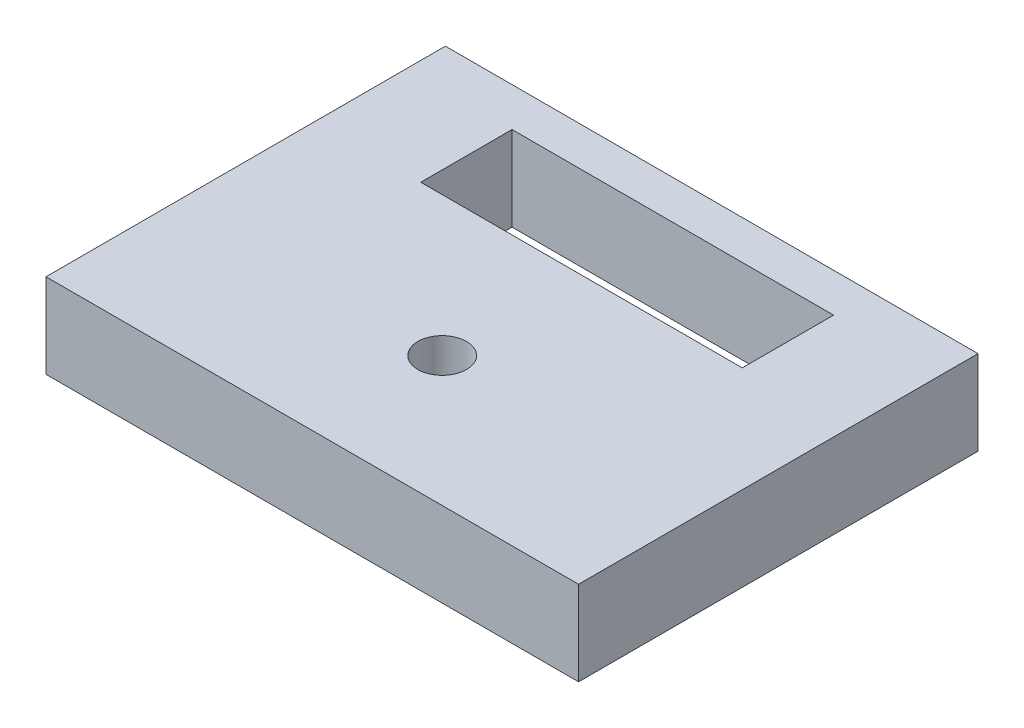
ISO-10303-21;
HEADER;
FILE_DESCRIPTION(('STEP AP214'),'2;1');
FILE_NAME('part.step','',(''),(''),'','','');
FILE_SCHEMA(('AUTOMOTIVE_DESIGN { 1 0 10303 214 1 1 1 1 }'));
ENDSEC;
DATA;
#1=APPLICATION_CONTEXT('core data for automotive mechanical design processes');
#2=APPLICATION_PROTOCOL_DEFINITION('international standard','automotive_design',2000,#1);
#3=PRODUCT_CONTEXT('',#1,'mechanical');
#4=PRODUCT('Part','Part','',(#3));
#5=PRODUCT_RELATED_PRODUCT_CATEGORY('part','',(#4));
#6=PRODUCT_DEFINITION_FORMATION('','',#4);
#7=PRODUCT_DEFINITION_CONTEXT('part definition',#1,'design');
#8=PRODUCT_DEFINITION('design','',#6,#7);
#9=PRODUCT_DEFINITION_SHAPE('','',#8);
#10=(LENGTH_UNIT() NAMED_UNIT(*) SI_UNIT(.MILLI.,.METRE.));
#11=(NAMED_UNIT(*) PLANE_ANGLE_UNIT() SI_UNIT($,.RADIAN.));
#12=(NAMED_UNIT(*) SI_UNIT($,.STERADIAN.) SOLID_ANGLE_UNIT());
#13=UNCERTAINTY_MEASURE_WITH_UNIT(LENGTH_MEASURE(1.E-05),#10,'distance_accuracy_value','');
#14=(GEOMETRIC_REPRESENTATION_CONTEXT(3) GLOBAL_UNCERTAINTY_ASSIGNED_CONTEXT((#13)) GLOBAL_UNIT_ASSIGNED_CONTEXT((#10,
#11,#12)) REPRESENTATION_CONTEXT('',''));
#15=CARTESIAN_POINT('',(0.,0.,0.));
#16=DIRECTION('',(0.,0.,1.));
#17=DIRECTION('',(1.,0.,0.));
#18=AXIS2_PLACEMENT_3D('',#15,#16,#17);
#19=CARTESIAN_POINT('',(-20.,6.35,15.));
#20=DIRECTION('',(0.,0.,-1.));
#21=DIRECTION('',(-1.,0.,0.));
#22=AXIS2_PLACEMENT_3D('',#19,#20,#21);
#23=PLANE('',#22);
#24=DIRECTION('',(1.,0.,0.));
#25=VECTOR('',#24,1.);
#26=CARTESIAN_POINT('',(-20.,0.,15.));
#27=LINE('',#26,#25);
#28=CARTESIAN_POINT('',(-20.,0.,15.));
#29=VERTEX_POINT('',#28);
#30=CARTESIAN_POINT('',(20.,0.,15.));
#31=VERTEX_POINT('',#30);
#32=EDGE_CURVE('E133',#29,#31,#27,.T.);
#33=ORIENTED_EDGE('',*,*,#32,.T.);
#34=DIRECTION('',(0.,-1.,0.));
#35=VECTOR('',#34,1.);
#36=CARTESIAN_POINT('',(20.,6.35,15.));
#37=LINE('',#36,#35);
#38=CARTESIAN_POINT('',(20.,6.35,15.));
#39=VERTEX_POINT('',#38);
#40=EDGE_CURVE('E11',#39,#31,#37,.T.);
#41=ORIENTED_EDGE('',*,*,#40,.F.);
#42=DIRECTION('',(1.,0.,0.));
#43=VECTOR('',#42,1.);
#44=CARTESIAN_POINT('',(-20.,6.35,15.));
#45=LINE('',#44,#43);
#46=CARTESIAN_POINT('',(-20.,6.35,15.));
#47=VERTEX_POINT('',#46);
#48=EDGE_CURVE('E137',#47,#39,#45,.T.);
#49=ORIENTED_EDGE('',*,*,#48,.F.);
#50=DIRECTION('',(0.,-1.,0.));
#51=VECTOR('',#50,1.);
#52=CARTESIAN_POINT('',(-20.,6.35,15.));
#53=LINE('',#52,#51);
#54=EDGE_CURVE('E147',#47,#29,#53,.T.);
#55=ORIENTED_EDGE('',*,*,#54,.T.);
#56=EDGE_LOOP('',(#33,#41,#49,#55));
#57=FACE_BOUND('',#56,.T.);
#58=ADVANCED_FACE('F33',(#57),#23,.F.);
#59=CARTESIAN_POINT('',(20.,6.35,15.));
#60=DIRECTION('',(-1.,0.,0.));
#61=DIRECTION('',(0.,0.,1.));
#62=AXIS2_PLACEMENT_3D('',#59,#60,#61);
#63=PLANE('',#62);
#64=DIRECTION('',(0.,0.,-1.));
#65=VECTOR('',#64,1.);
#66=CARTESIAN_POINT('',(20.,0.,15.));
#67=LINE('',#66,#65);
#68=CARTESIAN_POINT('',(20.,0.,-15.));
#69=VERTEX_POINT('',#68);
#70=EDGE_CURVE('E150',#31,#69,#67,.T.);
#71=ORIENTED_EDGE('',*,*,#70,.T.);
#72=DIRECTION('',(0.,-1.,0.));
#73=VECTOR('',#72,1.);
#74=CARTESIAN_POINT('',(20.,6.35,-15.));
#75=LINE('',#74,#73);
#76=CARTESIAN_POINT('',(20.,6.35,-15.));
#77=VERTEX_POINT('',#76);
#78=EDGE_CURVE('E40',#77,#69,#75,.T.);
#79=ORIENTED_EDGE('',*,*,#78,.F.);
#80=DIRECTION('',(0.,0.,-1.));
#81=VECTOR('',#80,1.);
#82=CARTESIAN_POINT('',(20.,6.35,15.));
#83=LINE('',#82,#81);
#84=EDGE_CURVE('E140',#39,#77,#83,.T.);
#85=ORIENTED_EDGE('',*,*,#84,.F.);
#86=ORIENTED_EDGE('',*,*,#40,.T.);
#87=EDGE_LOOP('',(#71,#79,#85,#86));
#88=FACE_BOUND('',#87,.T.);
#89=ADVANCED_FACE('F178',(#88),#63,.F.);
#90=CARTESIAN_POINT('',(-20.,6.35,-15.));
#91=DIRECTION('',(0.,0.,1.));
#92=DIRECTION('',(1.,0.,0.));
#93=AXIS2_PLACEMENT_3D('',#90,#91,#92);
#94=PLANE('',#93);
#95=DIRECTION('',(-1.,0.,0.));
#96=VECTOR('',#95,1.);
#97=CARTESIAN_POINT('',(-20.,0.,-15.));
#98=LINE('',#97,#96);
#99=CARTESIAN_POINT('',(-20.,0.,-15.));
#100=VERTEX_POINT('',#99);
#101=EDGE_CURVE('E152',#69,#100,#98,.T.);
#102=ORIENTED_EDGE('',*,*,#101,.T.);
#103=DIRECTION('',(0.,-1.,0.));
#104=VECTOR('',#103,1.);
#105=CARTESIAN_POINT('',(-20.,6.35,-15.));
#106=LINE('',#105,#104);
#107=CARTESIAN_POINT('',(-20.,6.35,-15.));
#108=VERTEX_POINT('',#107);
#109=EDGE_CURVE('E157',#108,#100,#106,.T.);
#110=ORIENTED_EDGE('',*,*,#109,.F.);
#111=DIRECTION('',(-1.,0.,0.));
#112=VECTOR('',#111,1.);
#113=CARTESIAN_POINT('',(-20.,6.35,-15.));
#114=LINE('',#113,#112);
#115=EDGE_CURVE('E143',#77,#108,#114,.T.);
#116=ORIENTED_EDGE('',*,*,#115,.F.);
#117=ORIENTED_EDGE('',*,*,#78,.T.);
#118=EDGE_LOOP('',(#102,#110,#116,#117));
#119=FACE_BOUND('',#118,.T.);
#120=ADVANCED_FACE('F164',(#119),#94,.F.);
#121=CARTESIAN_POINT('',(-20.,6.35,15.));
#122=DIRECTION('',(1.,0.,0.));
#123=DIRECTION('',(0.,0.,-1.));
#124=AXIS2_PLACEMENT_3D('',#121,#122,#123);
#125=PLANE('',#124);
#126=DIRECTION('',(0.,0.,1.));
#127=VECTOR('',#126,1.);
#128=CARTESIAN_POINT('',(-20.,0.,15.));
#129=LINE('',#128,#127);
#130=EDGE_CURVE('E141',#100,#29,#129,.T.);
#131=ORIENTED_EDGE('',*,*,#130,.T.);
#132=ORIENTED_EDGE('',*,*,#54,.F.);
#133=DIRECTION('',(0.,0.,1.));
#134=VECTOR('',#133,1.);
#135=CARTESIAN_POINT('',(-20.,6.35,15.));
#136=LINE('',#135,#134);
#137=EDGE_CURVE('E145',#108,#47,#136,.T.);
#138=ORIENTED_EDGE('',*,*,#137,.F.);
#139=ORIENTED_EDGE('',*,*,#109,.T.);
#140=EDGE_LOOP('',(#131,#132,#138,#139));
#141=FACE_BOUND('',#140,.T.);
#142=ADVANCED_FACE('F171',(#141),#125,.F.);
#143=CARTESIAN_POINT('',(0.,6.35,0.));
#144=DIRECTION('',(0.,1.,0.));
#145=DIRECTION('',(0.,0.,1.));
#146=AXIS2_PLACEMENT_3D('',#143,#144,#145);
#147=PLANE('',#146);
#148=CARTESIAN_POINT('',(0.,6.35,5.24379999999999));
#149=DIRECTION('',(0.,1.,0.));
#150=DIRECTION('',(0.,0.,1.));
#151=AXIS2_PLACEMENT_3D('',#148,#149,#150);
#152=CIRCLE('',#151,1.82879999999999);
#153=CARTESIAN_POINT('',(0.,6.35,7.07259999999998));
#154=VERTEX_POINT('',#153);
#155=EDGE_CURVE('E215',#154,#154,#152,.T.);
#156=ORIENTED_EDGE('',*,*,#155,.F.);
#157=EDGE_LOOP('',(#156));
#158=FACE_BOUND('',#157,.T.);
#159=DIRECTION('',(1.,0.,0.));
#160=VECTOR('',#159,1.);
#161=CARTESIAN_POINT('',(-12.074,6.35,-5.22100000000001));
#162=LINE('',#161,#160);
#163=CARTESIAN_POINT('',(-12.074,6.35,-5.22100000000001));
#164=VERTEX_POINT('',#163);
#165=CARTESIAN_POINT('',(12.074,6.35,-5.22100000000001));
#166=VERTEX_POINT('',#165);
#167=EDGE_CURVE('E47',#164,#166,#162,.T.);
#168=ORIENTED_EDGE('',*,*,#167,.F.);
#169=DIRECTION('',(0.,0.,1.));
#170=VECTOR('',#169,1.);
#171=CARTESIAN_POINT('',(-12.074,6.35,-5.22100000000001));
#172=LINE('',#171,#170);
#173=CARTESIAN_POINT('',(-12.074,6.35,-12.079));
#174=VERTEX_POINT('',#173);
#175=EDGE_CURVE('E115',#174,#164,#172,.T.);
#176=ORIENTED_EDGE('',*,*,#175,.F.);
#177=DIRECTION('',(-1.,0.,0.));
#178=VECTOR('',#177,1.);
#179=CARTESIAN_POINT('',(-12.074,6.35,-12.079));
#180=LINE('',#179,#178);
#181=CARTESIAN_POINT('',(12.074,6.35,-12.079));
#182=VERTEX_POINT('',#181);
#183=EDGE_CURVE('E118',#182,#174,#180,.T.);
#184=ORIENTED_EDGE('',*,*,#183,.F.);
#185=DIRECTION('',(0.,0.,-1.));
#186=VECTOR('',#185,1.);
#187=CARTESIAN_POINT('',(12.074,6.35,-5.22100000000001));
#188=LINE('',#187,#186);
#189=EDGE_CURVE('E127',#166,#182,#188,.T.);
#190=ORIENTED_EDGE('',*,*,#189,.F.);
#191=EDGE_LOOP('',(#168,#176,#184,#190));
#192=FACE_BOUND('',#191,.T.);
#193=ORIENTED_EDGE('',*,*,#48,.T.);
#194=ORIENTED_EDGE('',*,*,#84,.T.);
#195=ORIENTED_EDGE('',*,*,#115,.T.);
#196=ORIENTED_EDGE('',*,*,#137,.T.);
#197=EDGE_LOOP('',(#193,#194,#195,#196));
#198=FACE_BOUND('',#197,.T.);
#199=ADVANCED_FACE('F177',(#158,#192,#198),#147,.T.);
#200=CARTESIAN_POINT('',(0.,0.,0.));
#201=DIRECTION('',(0.,1.,0.));
#202=DIRECTION('',(0.,0.,1.));
#203=AXIS2_PLACEMENT_3D('',#200,#201,#202);
#204=PLANE('',#203);
#205=CARTESIAN_POINT('',(0.,0.,5.24379999999999));
#206=DIRECTION('',(0.,1.,0.));
#207=DIRECTION('',(0.,0.,1.));
#208=AXIS2_PLACEMENT_3D('',#205,#206,#207);
#209=CIRCLE('',#208,1.82879999999999);
#210=CARTESIAN_POINT('',(0.,0.,7.07259999999998));
#211=VERTEX_POINT('',#210);
#212=EDGE_CURVE('E121',#211,#211,#209,.T.);
#213=ORIENTED_EDGE('',*,*,#212,.T.);
#214=EDGE_LOOP('',(#213));
#215=FACE_BOUND('',#214,.T.);
#216=DIRECTION('',(0.,0.,1.));
#217=VECTOR('',#216,1.);
#218=CARTESIAN_POINT('',(-12.074,0.,-5.22100000000001));
#219=LINE('',#218,#217);
#220=CARTESIAN_POINT('',(-12.074,0.,-12.079));
#221=VERTEX_POINT('',#220);
#222=CARTESIAN_POINT('',(-12.074,0.,-5.22100000000001));
#223=VERTEX_POINT('',#222);
#224=EDGE_CURVE('E105',#221,#223,#219,.T.);
#225=ORIENTED_EDGE('',*,*,#224,.T.);
#226=DIRECTION('',(1.,0.,0.));
#227=VECTOR('',#226,1.);
#228=CARTESIAN_POINT('',(-12.074,0.,-5.22100000000001));
#229=LINE('',#228,#227);
#230=CARTESIAN_POINT('',(12.074,0.,-5.22100000000001));
#231=VERTEX_POINT('',#230);
#232=EDGE_CURVE('E99',#223,#231,#229,.T.);
#233=ORIENTED_EDGE('',*,*,#232,.T.);
#234=DIRECTION('',(0.,0.,-1.));
#235=VECTOR('',#234,1.);
#236=CARTESIAN_POINT('',(12.074,0.,-5.22100000000001));
#237=LINE('',#236,#235);
#238=CARTESIAN_POINT('',(12.074,0.,-12.079));
#239=VERTEX_POINT('',#238);
#240=EDGE_CURVE('E108',#231,#239,#237,.T.);
#241=ORIENTED_EDGE('',*,*,#240,.T.);
#242=DIRECTION('',(-1.,0.,0.));
#243=VECTOR('',#242,1.);
#244=CARTESIAN_POINT('',(-12.074,0.,-12.079));
#245=LINE('',#244,#243);
#246=EDGE_CURVE('E55',#239,#221,#245,.T.);
#247=ORIENTED_EDGE('',*,*,#246,.T.);
#248=EDGE_LOOP('',(#225,#233,#241,#247));
#249=FACE_BOUND('',#248,.T.);
#250=ORIENTED_EDGE('',*,*,#32,.F.);
#251=ORIENTED_EDGE('',*,*,#130,.F.);
#252=ORIENTED_EDGE('',*,*,#101,.F.);
#253=ORIENTED_EDGE('',*,*,#70,.F.);
#254=EDGE_LOOP('',(#250,#251,#252,#253));
#255=FACE_BOUND('',#254,.T.);
#256=ADVANCED_FACE('F112',(#215,#249,#255),#204,.F.);
#257=CARTESIAN_POINT('',(-12.074,0.,-5.22100000000001));
#258=DIRECTION('',(0.,0.,1.));
#259=DIRECTION('',(1.,0.,0.));
#260=AXIS2_PLACEMENT_3D('',#257,#258,#259);
#261=PLANE('',#260);
#262=ORIENTED_EDGE('',*,*,#167,.T.);
#263=DIRECTION('',(0.,1.,0.));
#264=VECTOR('',#263,1.);
#265=CARTESIAN_POINT('',(12.074,0.,-5.22100000000001));
#266=LINE('',#265,#264);
#267=EDGE_CURVE('E95',#231,#166,#266,.T.);
#268=ORIENTED_EDGE('',*,*,#267,.F.);
#269=ORIENTED_EDGE('',*,*,#232,.F.);
#270=DIRECTION('',(0.,1.,0.));
#271=VECTOR('',#270,1.);
#272=CARTESIAN_POINT('',(-12.074,0.,-5.22100000000001));
#273=LINE('',#272,#271);
#274=EDGE_CURVE('E131',#223,#164,#273,.T.);
#275=ORIENTED_EDGE('',*,*,#274,.T.);
#276=EDGE_LOOP('',(#262,#268,#269,#275));
#277=FACE_BOUND('',#276,.T.);
#278=ADVANCED_FACE('F97',(#277),#261,.F.);
#279=CARTESIAN_POINT('',(-12.074,0.,-5.22100000000001));
#280=DIRECTION('',(-1.,0.,0.));
#281=DIRECTION('',(0.,0.,1.));
#282=AXIS2_PLACEMENT_3D('',#279,#280,#281);
#283=PLANE('',#282);
#284=ORIENTED_EDGE('',*,*,#175,.T.);
#285=ORIENTED_EDGE('',*,*,#274,.F.);
#286=ORIENTED_EDGE('',*,*,#224,.F.);
#287=DIRECTION('',(0.,1.,0.));
#288=VECTOR('',#287,1.);
#289=CARTESIAN_POINT('',(-12.074,0.,-12.079));
#290=LINE('',#289,#288);
#291=EDGE_CURVE('E134',#221,#174,#290,.T.);
#292=ORIENTED_EDGE('',*,*,#291,.T.);
#293=EDGE_LOOP('',(#284,#285,#286,#292));
#294=FACE_BOUND('',#293,.T.);
#295=ADVANCED_FACE('F196',(#294),#283,.F.);
#296=CARTESIAN_POINT('',(-12.074,0.,-12.079));
#297=DIRECTION('',(0.,0.,-1.));
#298=DIRECTION('',(-1.,0.,0.));
#299=AXIS2_PLACEMENT_3D('',#296,#297,#298);
#300=PLANE('',#299);
#301=ORIENTED_EDGE('',*,*,#183,.T.);
#302=ORIENTED_EDGE('',*,*,#291,.F.);
#303=ORIENTED_EDGE('',*,*,#246,.F.);
#304=DIRECTION('',(0.,1.,0.));
#305=VECTOR('',#304,1.);
#306=CARTESIAN_POINT('',(12.074,0.,-12.079));
#307=LINE('',#306,#305);
#308=EDGE_CURVE('E104',#239,#182,#307,.T.);
#309=ORIENTED_EDGE('',*,*,#308,.T.);
#310=EDGE_LOOP('',(#301,#302,#303,#309));
#311=FACE_BOUND('',#310,.T.);
#312=ADVANCED_FACE('F200',(#311),#300,.F.);
#313=CARTESIAN_POINT('',(12.074,0.,-5.22100000000001));
#314=DIRECTION('',(1.,0.,0.));
#315=DIRECTION('',(0.,0.,-1.));
#316=AXIS2_PLACEMENT_3D('',#313,#314,#315);
#317=PLANE('',#316);
#318=ORIENTED_EDGE('',*,*,#189,.T.);
#319=ORIENTED_EDGE('',*,*,#308,.F.);
#320=ORIENTED_EDGE('',*,*,#240,.F.);
#321=ORIENTED_EDGE('',*,*,#267,.T.);
#322=EDGE_LOOP('',(#318,#319,#320,#321));
#323=FACE_BOUND('',#322,.T.);
#324=ADVANCED_FACE('F109',(#323),#317,.F.);
#325=CARTESIAN_POINT('',(0.,6.35,5.24379999999999));
#326=DIRECTION('',(0.,1.,0.));
#327=DIRECTION('',(0.,0.,1.));
#328=AXIS2_PLACEMENT_3D('',#325,#326,#327);
#329=CYLINDRICAL_SURFACE('',#328,1.82879999999999);
#330=ORIENTED_EDGE('',*,*,#212,.F.);
#331=EDGE_LOOP('',(#330));
#332=FACE_BOUND('',#331,.T.);
#333=ORIENTED_EDGE('',*,*,#155,.T.);
#334=EDGE_LOOP('',(#333));
#335=FACE_BOUND('',#334,.T.);
#336=ADVANCED_FACE('F199',(#332,#335),#329,.F.);
#337=CLOSED_SHELL('',(#58,#89,#120,#142,#199,#256,#278,#295,#312,#324,#336));
#338=MANIFOLD_SOLID_BREP('B2',#337);
#339=ADVANCED_BREP_SHAPE_REPRESENTATION('',(#18,#338),#14);
#340=SHAPE_DEFINITION_REPRESENTATION(#9,#339);
ENDSEC;
END-ISO-10303-21;
